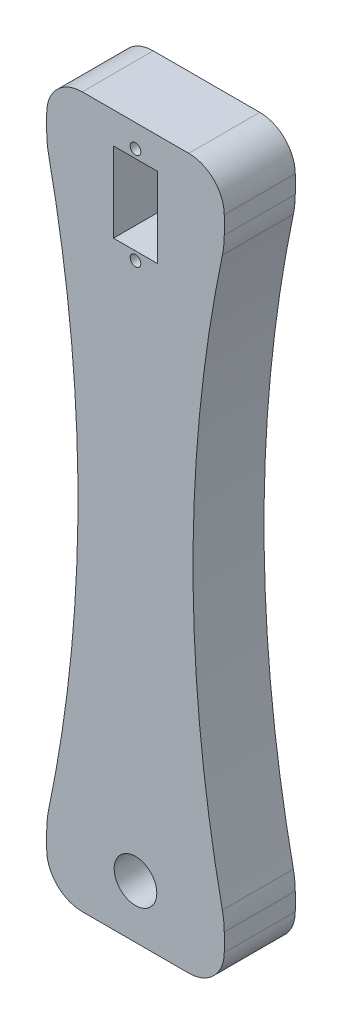
ISO-10303-21;
HEADER;
FILE_DESCRIPTION(('STEP AP214'),'2;1');
FILE_NAME('part.step','',(''),(''),'','','');
FILE_SCHEMA(('AUTOMOTIVE_DESIGN { 1 0 10303 214 1 1 1 1 }'));
ENDSEC;
DATA;
#1=APPLICATION_CONTEXT('core data for automotive mechanical design processes');
#2=APPLICATION_PROTOCOL_DEFINITION('international standard','automotive_design',2000,#1);
#3=PRODUCT_CONTEXT('',#1,'mechanical');
#4=PRODUCT('Part','Part','',(#3));
#5=PRODUCT_RELATED_PRODUCT_CATEGORY('part','',(#4));
#6=PRODUCT_DEFINITION_FORMATION('','',#4);
#7=PRODUCT_DEFINITION_CONTEXT('part definition',#1,'design');
#8=PRODUCT_DEFINITION('design','',#6,#7);
#9=PRODUCT_DEFINITION_SHAPE('','',#8);
#10=(LENGTH_UNIT() NAMED_UNIT(*) SI_UNIT(.MILLI.,.METRE.));
#11=(NAMED_UNIT(*) PLANE_ANGLE_UNIT() SI_UNIT($,.RADIAN.));
#12=(NAMED_UNIT(*) SI_UNIT($,.STERADIAN.) SOLID_ANGLE_UNIT());
#13=UNCERTAINTY_MEASURE_WITH_UNIT(LENGTH_MEASURE(1.E-05),#10,'distance_accuracy_value','');
#14=(GEOMETRIC_REPRESENTATION_CONTEXT(3) GLOBAL_UNCERTAINTY_ASSIGNED_CONTEXT((#13)) GLOBAL_UNIT_ASSIGNED_CONTEXT((#10,
#11,#12)) REPRESENTATION_CONTEXT('',''));
#15=CARTESIAN_POINT('',(0.,0.,0.));
#16=DIRECTION('',(0.,0.,1.));
#17=DIRECTION('',(1.,0.,0.));
#18=AXIS2_PLACEMENT_3D('',#15,#16,#17);
#19=CARTESIAN_POINT('',(0.,0.,20.));
#20=DIRECTION('',(1.,0.,0.));
#21=DIRECTION('',(0.,1.,0.));
#22=AXIS2_PLACEMENT_3D('',#19,#20,#21);
#23=PLANE('',#22);
#24=DIRECTION('',(0.,0.,-1.));
#25=VECTOR('',#24,1.);
#26=CARTESIAN_POINT('',(0.,-185.,20.000012));
#27=LINE('',#26,#25);
#28=CARTESIAN_POINT('',(0.,-185.,0.));
#29=VERTEX_POINT('',#28);
#30=CARTESIAN_POINT('',(0.,-185.,20.));
#31=VERTEX_POINT('',#30);
#32=EDGE_CURVE('E707',#29,#31,#27,.F.);
#33=ORIENTED_EDGE('',*,*,#32,.F.);
#34=DIRECTION('',(0.,-1.,0.));
#35=VECTOR('',#34,1.);
#36=CARTESIAN_POINT('',(0.,0.,0.));
#37=LINE('',#36,#35);
#38=CARTESIAN_POINT('',(0.,-190.,0.));
#39=VERTEX_POINT('',#38);
#40=EDGE_CURVE('E226',#29,#39,#37,.T.);
#41=ORIENTED_EDGE('',*,*,#40,.T.);
#42=DIRECTION('',(0.,0.,-1.));
#43=VECTOR('',#42,1.);
#44=CARTESIAN_POINT('',(0.,-190.,20.));
#45=LINE('',#44,#43);
#46=CARTESIAN_POINT('',(0.,-190.,20.));
#47=VERTEX_POINT('',#46);
#48=EDGE_CURVE('E258',#39,#47,#45,.F.);
#49=ORIENTED_EDGE('',*,*,#48,.T.);
#50=DIRECTION('',(0.,-1.,0.));
#51=VECTOR('',#50,1.);
#52=CARTESIAN_POINT('',(0.,0.,20.));
#53=LINE('',#52,#51);
#54=EDGE_CURVE('E236',#31,#47,#53,.T.);
#55=ORIENTED_EDGE('',*,*,#54,.F.);
#56=EDGE_LOOP('',(#33,#41,#49,#55));
#57=FACE_BOUND('',#56,.T.);
#58=ADVANCED_FACE('F38',(#57),#23,.F.);
#59=CARTESIAN_POINT('',(50.,0.,20.));
#60=DIRECTION('',(-1.,0.,0.));
#61=DIRECTION('',(0.,-1.,0.));
#62=AXIS2_PLACEMENT_3D('',#59,#60,#61);
#63=PLANE('',#62);
#64=DIRECTION('',(0.,0.,-1.));
#65=VECTOR('',#64,1.);
#66=CARTESIAN_POINT('',(50.,-15.,20.000012));
#67=LINE('',#66,#65);
#68=CARTESIAN_POINT('',(50.,-15.,0.));
#69=VERTEX_POINT('',#68);
#70=CARTESIAN_POINT('',(50.,-15.,20.));
#71=VERTEX_POINT('',#70);
#72=EDGE_CURVE('E175',#69,#71,#67,.F.);
#73=ORIENTED_EDGE('',*,*,#72,.F.);
#74=DIRECTION('',(0.,1.,0.));
#75=VECTOR('',#74,1.);
#76=CARTESIAN_POINT('',(50.,0.,0.));
#77=LINE('',#76,#75);
#78=CARTESIAN_POINT('',(50.,-10.,0.));
#79=VERTEX_POINT('',#78);
#80=EDGE_CURVE('E229',#69,#79,#77,.T.);
#81=ORIENTED_EDGE('',*,*,#80,.T.);
#82=DIRECTION('',(0.,0.,-1.));
#83=VECTOR('',#82,1.);
#84=CARTESIAN_POINT('',(50.,-10.,20.));
#85=LINE('',#84,#83);
#86=CARTESIAN_POINT('',(50.,-10.,20.));
#87=VERTEX_POINT('',#86);
#88=EDGE_CURVE('E200',#79,#87,#85,.F.);
#89=ORIENTED_EDGE('',*,*,#88,.T.);
#90=DIRECTION('',(0.,1.,0.));
#91=VECTOR('',#90,1.);
#92=CARTESIAN_POINT('',(50.,0.,20.));
#93=LINE('',#92,#91);
#94=EDGE_CURVE('E193',#71,#87,#93,.T.);
#95=ORIENTED_EDGE('',*,*,#94,.F.);
#96=EDGE_LOOP('',(#73,#81,#89,#95));
#97=FACE_BOUND('',#96,.T.);
#98=ADVANCED_FACE('F198',(#97),#63,.F.);
#99=CARTESIAN_POINT('',(0.,0.,20.));
#100=DIRECTION('',(0.,0.,1.));
#101=DIRECTION('',(1.,0.,0.));
#102=AXIS2_PLACEMENT_3D('',#99,#100,#101);
#103=PLANE('',#102);
#104=CARTESIAN_POINT('',(25.,-15.,20.));
#105=DIRECTION('',(0.,0.,1.));
#106=DIRECTION('',(1.,0.,0.));
#107=AXIS2_PLACEMENT_3D('',#104,#105,#106);
#108=CIRCLE('',#107,25.);
#109=CARTESIAN_POINT('',(49.4699951946866,-20.1204819277109,20.));
#110=VERTEX_POINT('',#109);
#111=EDGE_CURVE('E179',#71,#110,#108,.F.);
#112=ORIENTED_EDGE('',*,*,#111,.F.);
#113=ORIENTED_EDGE('',*,*,#94,.T.);
#114=CARTESIAN_POINT('',(40.,-10.,20.));
#115=DIRECTION('',(0.,0.,1.));
#116=DIRECTION('',(1.,0.,0.));
#117=AXIS2_PLACEMENT_3D('',#114,#115,#116);
#118=CIRCLE('',#117,10.);
#119=CARTESIAN_POINT('',(40.,0.,20.));
#120=VERTEX_POINT('',#119);
#121=EDGE_CURVE('E263',#87,#120,#118,.T.);
#122=ORIENTED_EDGE('',*,*,#121,.T.);
#123=DIRECTION('',(-1.,0.,0.));
#124=VECTOR('',#123,1.);
#125=CARTESIAN_POINT('',(0.,0.,20.));
#126=LINE('',#125,#124);
#127=CARTESIAN_POINT('',(10.,0.,20.));
#128=VERTEX_POINT('',#127);
#129=EDGE_CURVE('E206',#120,#128,#126,.T.);
#130=ORIENTED_EDGE('',*,*,#129,.T.);
#131=CARTESIAN_POINT('',(10.,-10.,20.));
#132=DIRECTION('',(0.,0.,1.));
#133=DIRECTION('',(1.,0.,0.));
#134=AXIS2_PLACEMENT_3D('',#131,#132,#133);
#135=CIRCLE('',#134,10.);
#136=CARTESIAN_POINT('',(0.,-10.,20.));
#137=VERTEX_POINT('',#136);
#138=EDGE_CURVE('E265',#128,#137,#135,.T.);
#139=ORIENTED_EDGE('',*,*,#138,.T.);
#140=CARTESIAN_POINT('',(0.,-15.,20.));
#141=VERTEX_POINT('',#140);
#142=EDGE_CURVE('E209',#137,#141,#53,.T.);
#143=ORIENTED_EDGE('',*,*,#142,.T.);
#144=CARTESIAN_POINT('',(25.,-15.,20.));
#145=DIRECTION('',(0.,0.,1.));
#146=DIRECTION('',(1.,0.,0.));
#147=AXIS2_PLACEMENT_3D('',#144,#145,#146);
#148=CIRCLE('',#147,25.);
#149=CARTESIAN_POINT('',(0.530004805313376,-20.1204819277108,20.));
#150=VERTEX_POINT('',#149);
#151=EDGE_CURVE('E53',#150,#141,#148,.F.);
#152=ORIENTED_EDGE('',*,*,#151,.F.);
#153=CARTESIAN_POINT('',(-381.201920231798,-100.,20.));
#154=DIRECTION('',(0.,0.,1.));
#155=DIRECTION('',(1.,0.,0.));
#156=AXIS2_PLACEMENT_3D('',#153,#154,#155);
#157=CIRCLE('',#156,390.);
#158=CARTESIAN_POINT('',(0.530004805313344,-179.879518072289,20.));
#159=VERTEX_POINT('',#158);
#160=EDGE_CURVE('E359',#150,#159,#157,.F.);
#161=ORIENTED_EDGE('',*,*,#160,.T.);
#162=CARTESIAN_POINT('',(25.,-185.,20.));
#163=DIRECTION('',(0.,0.,1.));
#164=DIRECTION('',(1.,0.,0.));
#165=AXIS2_PLACEMENT_3D('',#162,#163,#164);
#166=CIRCLE('',#165,25.);
#167=EDGE_CURVE('E316',#31,#159,#166,.F.);
#168=ORIENTED_EDGE('',*,*,#167,.F.);
#169=ORIENTED_EDGE('',*,*,#54,.T.);
#170=CARTESIAN_POINT('',(10.,-190.,20.));
#171=DIRECTION('',(0.,0.,1.));
#172=DIRECTION('',(1.,0.,0.));
#173=AXIS2_PLACEMENT_3D('',#170,#171,#172);
#174=CIRCLE('',#173,10.);
#175=CARTESIAN_POINT('',(10.,-200.,20.));
#176=VERTEX_POINT('',#175);
#177=EDGE_CURVE('E267',#47,#176,#174,.T.);
#178=ORIENTED_EDGE('',*,*,#177,.T.);
#179=DIRECTION('',(1.,0.,0.));
#180=VECTOR('',#179,1.);
#181=CARTESIAN_POINT('',(0.,-200.,20.));
#182=LINE('',#181,#180);
#183=CARTESIAN_POINT('',(40.,-200.,20.));
#184=VERTEX_POINT('',#183);
#185=EDGE_CURVE('E203',#176,#184,#182,.T.);
#186=ORIENTED_EDGE('',*,*,#185,.T.);
#187=CARTESIAN_POINT('',(40.,-190.,20.));
#188=DIRECTION('',(0.,0.,1.));
#189=DIRECTION('',(1.,0.,0.));
#190=AXIS2_PLACEMENT_3D('',#187,#188,#189);
#191=CIRCLE('',#190,10.);
#192=CARTESIAN_POINT('',(50.,-190.,20.));
#193=VERTEX_POINT('',#192);
#194=EDGE_CURVE('E261',#184,#193,#191,.T.);
#195=ORIENTED_EDGE('',*,*,#194,.T.);
#196=CARTESIAN_POINT('',(50.,-185.,20.));
#197=VERTEX_POINT('',#196);
#198=EDGE_CURVE('E202',#193,#197,#93,.T.);
#199=ORIENTED_EDGE('',*,*,#198,.T.);
#200=CARTESIAN_POINT('',(25.,-185.,20.));
#201=DIRECTION('',(0.,0.,1.));
#202=DIRECTION('',(1.,0.,0.));
#203=AXIS2_PLACEMENT_3D('',#200,#201,#202);
#204=CIRCLE('',#203,25.);
#205=CARTESIAN_POINT('',(49.4699951946867,-179.879518072289,20.));
#206=VERTEX_POINT('',#205);
#207=EDGE_CURVE('E61',#206,#197,#204,.F.);
#208=ORIENTED_EDGE('',*,*,#207,.F.);
#209=CARTESIAN_POINT('',(431.201920231798,-99.9999999999999,20.));
#210=DIRECTION('',(0.,0.,1.));
#211=DIRECTION('',(1.,0.,0.));
#212=AXIS2_PLACEMENT_3D('',#209,#210,#211);
#213=CIRCLE('',#212,390.);
#214=EDGE_CURVE('E195',#206,#110,#213,.F.);
#215=ORIENTED_EDGE('',*,*,#214,.T.);
#216=EDGE_LOOP('',(#112,#113,#122,#130,#139,#143,#152,#161,#168,#169,#178,#186,#195,#199,#208,#215));
#217=FACE_BOUND('',#216,.T.);
#218=CARTESIAN_POINT('',(25.,-6.4,20.));
#219=DIRECTION('',(0.,0.,1.));
#220=DIRECTION('',(1.,0.,0.));
#221=AXIS2_PLACEMENT_3D('',#218,#219,#220);
#222=CIRCLE('',#221,1.5);
#223=CARTESIAN_POINT('',(26.5,-6.4,20.));
#224=VERTEX_POINT('',#223);
#225=EDGE_CURVE('E364',#224,#224,#222,.T.);
#226=ORIENTED_EDGE('',*,*,#225,.F.);
#227=EDGE_LOOP('',(#226));
#228=FACE_BOUND('',#227,.T.);
#229=CARTESIAN_POINT('',(25.,-33.7,20.));
#230=DIRECTION('',(0.,0.,1.));
#231=DIRECTION('',(1.,0.,0.));
#232=AXIS2_PLACEMENT_3D('',#229,#230,#231);
#233=CIRCLE('',#232,1.5);
#234=CARTESIAN_POINT('',(26.5,-33.7,20.));
#235=VERTEX_POINT('',#234);
#236=EDGE_CURVE('E365',#235,#235,#233,.T.);
#237=ORIENTED_EDGE('',*,*,#236,.F.);
#238=EDGE_LOOP('',(#237));
#239=FACE_BOUND('',#238,.T.);
#240=CARTESIAN_POINT('',(25.,-185.,20.));
#241=DIRECTION('',(0.,0.,1.));
#242=DIRECTION('',(1.,0.,0.));
#243=AXIS2_PLACEMENT_3D('',#240,#241,#242);
#244=CIRCLE('',#243,6.);
#245=CARTESIAN_POINT('',(31.,-185.,20.));
#246=VERTEX_POINT('',#245);
#247=EDGE_CURVE('E240',#246,#246,#244,.T.);
#248=ORIENTED_EDGE('',*,*,#247,.F.);
#249=EDGE_LOOP('',(#248));
#250=FACE_BOUND('',#249,.T.);
#251=DIRECTION('',(0.,1.,0.));
#252=VECTOR('',#251,1.);
#253=CARTESIAN_POINT('',(18.8,0.,20.));
#254=LINE('',#253,#252);
#255=CARTESIAN_POINT('',(18.8,-31.3,20.));
#256=VERTEX_POINT('',#255);
#257=CARTESIAN_POINT('',(18.8,-8.8,20.));
#258=VERTEX_POINT('',#257);
#259=EDGE_CURVE('E373',#256,#258,#254,.T.);
#260=ORIENTED_EDGE('',*,*,#259,.T.);
#261=DIRECTION('',(1.,0.,0.));
#262=VECTOR('',#261,1.);
#263=CARTESIAN_POINT('',(0.,-8.8,20.));
#264=LINE('',#263,#262);
#265=CARTESIAN_POINT('',(31.2,-8.8,20.));
#266=VERTEX_POINT('',#265);
#267=EDGE_CURVE('E368',#258,#266,#264,.T.);
#268=ORIENTED_EDGE('',*,*,#267,.T.);
#269=DIRECTION('',(0.,-1.,0.));
#270=VECTOR('',#269,1.);
#271=CARTESIAN_POINT('',(31.2,0.,20.));
#272=LINE('',#271,#270);
#273=CARTESIAN_POINT('',(31.2,-31.3,20.));
#274=VERTEX_POINT('',#273);
#275=EDGE_CURVE('E379',#266,#274,#272,.T.);
#276=ORIENTED_EDGE('',*,*,#275,.T.);
#277=DIRECTION('',(-1.,0.,0.));
#278=VECTOR('',#277,1.);
#279=CARTESIAN_POINT('',(0.,-31.3,20.));
#280=LINE('',#279,#278);
#281=EDGE_CURVE('E376',#274,#256,#280,.T.);
#282=ORIENTED_EDGE('',*,*,#281,.T.);
#283=EDGE_LOOP('',(#260,#268,#276,#282));
#284=FACE_BOUND('',#283,.T.);
#285=ADVANCED_FACE('F191',(#217,#228,#239,#250,#284),#103,.T.);
#286=CARTESIAN_POINT('',(0.,0.,0.));
#287=DIRECTION('',(0.,0.,1.));
#288=DIRECTION('',(1.,0.,0.));
#289=AXIS2_PLACEMENT_3D('',#286,#287,#288);
#290=PLANE('',#289);
#291=CARTESIAN_POINT('',(25.,-6.4,0.));
#292=DIRECTION('',(0.,0.,1.));
#293=DIRECTION('',(1.,0.,0.));
#294=AXIS2_PLACEMENT_3D('',#291,#292,#293);
#295=CIRCLE('',#294,1.5);
#296=CARTESIAN_POINT('',(26.5,-6.4,0.));
#297=VERTEX_POINT('',#296);
#298=EDGE_CURVE('E289',#297,#297,#295,.T.);
#299=ORIENTED_EDGE('',*,*,#298,.T.);
#300=EDGE_LOOP('',(#299));
#301=FACE_BOUND('',#300,.T.);
#302=CARTESIAN_POINT('',(25.,-33.7,0.));
#303=DIRECTION('',(0.,0.,1.));
#304=DIRECTION('',(1.,0.,0.));
#305=AXIS2_PLACEMENT_3D('',#302,#303,#304);
#306=CIRCLE('',#305,1.5);
#307=CARTESIAN_POINT('',(26.5,-33.7,0.));
#308=VERTEX_POINT('',#307);
#309=EDGE_CURVE('E287',#308,#308,#306,.T.);
#310=ORIENTED_EDGE('',*,*,#309,.T.);
#311=EDGE_LOOP('',(#310));
#312=FACE_BOUND('',#311,.T.);
#313=ORIENTED_EDGE('',*,*,#80,.F.);
#314=CARTESIAN_POINT('',(25.,-15.,0.));
#315=DIRECTION('',(0.,0.,1.));
#316=DIRECTION('',(1.,0.,0.));
#317=AXIS2_PLACEMENT_3D('',#314,#315,#316);
#318=CIRCLE('',#317,25.);
#319=CARTESIAN_POINT('',(49.4699951946866,-20.1204819277109,0.));
#320=VERTEX_POINT('',#319);
#321=EDGE_CURVE('E182',#69,#320,#318,.F.);
#322=ORIENTED_EDGE('',*,*,#321,.T.);
#323=CARTESIAN_POINT('',(431.201920231798,-99.9999999999999,0.));
#324=DIRECTION('',(0.,0.,1.));
#325=DIRECTION('',(1.,0.,0.));
#326=AXIS2_PLACEMENT_3D('',#323,#324,#325);
#327=CIRCLE('',#326,390.);
#328=CARTESIAN_POINT('',(49.4699951946867,-179.879518072289,0.));
#329=VERTEX_POINT('',#328);
#330=EDGE_CURVE('E12',#329,#320,#327,.F.);
#331=ORIENTED_EDGE('',*,*,#330,.F.);
#332=CARTESIAN_POINT('',(25.,-185.,0.));
#333=DIRECTION('',(0.,0.,1.));
#334=DIRECTION('',(1.,0.,0.));
#335=AXIS2_PLACEMENT_3D('',#332,#333,#334);
#336=CIRCLE('',#335,25.);
#337=CARTESIAN_POINT('',(50.,-185.,0.));
#338=VERTEX_POINT('',#337);
#339=EDGE_CURVE('E339',#329,#338,#336,.F.);
#340=ORIENTED_EDGE('',*,*,#339,.T.);
#341=CARTESIAN_POINT('',(50.,-190.,0.));
#342=VERTEX_POINT('',#341);
#343=EDGE_CURVE('E230',#342,#338,#77,.T.);
#344=ORIENTED_EDGE('',*,*,#343,.F.);
#345=CARTESIAN_POINT('',(40.,-190.,0.));
#346=DIRECTION('',(0.,0.,1.));
#347=DIRECTION('',(1.,0.,0.));
#348=AXIS2_PLACEMENT_3D('',#345,#346,#347);
#349=CIRCLE('',#348,10.);
#350=CARTESIAN_POINT('',(40.,-200.,0.));
#351=VERTEX_POINT('',#350);
#352=EDGE_CURVE('E245',#342,#351,#349,.F.);
#353=ORIENTED_EDGE('',*,*,#352,.T.);
#354=DIRECTION('',(1.,0.,0.));
#355=VECTOR('',#354,1.);
#356=CARTESIAN_POINT('',(0.,-200.,0.));
#357=LINE('',#356,#355);
#358=CARTESIAN_POINT('',(10.,-200.,0.));
#359=VERTEX_POINT('',#358);
#360=EDGE_CURVE('E225',#359,#351,#357,.T.);
#361=ORIENTED_EDGE('',*,*,#360,.F.);
#362=CARTESIAN_POINT('',(10.,-190.,0.));
#363=DIRECTION('',(0.,0.,1.));
#364=DIRECTION('',(1.,0.,0.));
#365=AXIS2_PLACEMENT_3D('',#362,#363,#364);
#366=CIRCLE('',#365,10.);
#367=EDGE_CURVE('E252',#359,#39,#366,.F.);
#368=ORIENTED_EDGE('',*,*,#367,.T.);
#369=ORIENTED_EDGE('',*,*,#40,.F.);
#370=CARTESIAN_POINT('',(25.,-185.,0.));
#371=DIRECTION('',(0.,0.,1.));
#372=DIRECTION('',(1.,0.,0.));
#373=AXIS2_PLACEMENT_3D('',#370,#371,#372);
#374=CIRCLE('',#373,25.);
#375=CARTESIAN_POINT('',(0.530004805313344,-179.879518072289,0.));
#376=VERTEX_POINT('',#375);
#377=EDGE_CURVE('E353',#29,#376,#374,.F.);
#378=ORIENTED_EDGE('',*,*,#377,.T.);
#379=CARTESIAN_POINT('',(-381.201920231798,-100.,0.));
#380=DIRECTION('',(0.,0.,1.));
#381=DIRECTION('',(1.,0.,0.));
#382=AXIS2_PLACEMENT_3D('',#379,#380,#381);
#383=CIRCLE('',#382,390.);
#384=CARTESIAN_POINT('',(0.530004805313376,-20.1204819277108,0.));
#385=VERTEX_POINT('',#384);
#386=EDGE_CURVE('E46',#385,#376,#383,.F.);
#387=ORIENTED_EDGE('',*,*,#386,.F.);
#388=CARTESIAN_POINT('',(25.,-15.,0.));
#389=DIRECTION('',(0.,0.,1.));
#390=DIRECTION('',(1.,0.,0.));
#391=AXIS2_PLACEMENT_3D('',#388,#389,#390);
#392=CIRCLE('',#391,25.);
#393=CARTESIAN_POINT('',(0.,-15.,0.));
#394=VERTEX_POINT('',#393);
#395=EDGE_CURVE('E196',#385,#394,#392,.F.);
#396=ORIENTED_EDGE('',*,*,#395,.T.);
#397=CARTESIAN_POINT('',(0.,-10.,0.));
#398=VERTEX_POINT('',#397);
#399=EDGE_CURVE('E222',#398,#394,#37,.T.);
#400=ORIENTED_EDGE('',*,*,#399,.F.);
#401=CARTESIAN_POINT('',(10.,-10.,0.));
#402=DIRECTION('',(0.,0.,1.));
#403=DIRECTION('',(1.,0.,0.));
#404=AXIS2_PLACEMENT_3D('',#401,#402,#403);
#405=CIRCLE('',#404,10.);
#406=CARTESIAN_POINT('',(10.,0.,0.));
#407=VERTEX_POINT('',#406);
#408=EDGE_CURVE('E250',#398,#407,#405,.F.);
#409=ORIENTED_EDGE('',*,*,#408,.T.);
#410=DIRECTION('',(-1.,0.,0.));
#411=VECTOR('',#410,1.);
#412=CARTESIAN_POINT('',(0.,0.,0.));
#413=LINE('',#412,#411);
#414=CARTESIAN_POINT('',(40.,0.,0.));
#415=VERTEX_POINT('',#414);
#416=EDGE_CURVE('E233',#415,#407,#413,.T.);
#417=ORIENTED_EDGE('',*,*,#416,.F.);
#418=CARTESIAN_POINT('',(40.,-10.,0.));
#419=DIRECTION('',(0.,0.,1.));
#420=DIRECTION('',(1.,0.,0.));
#421=AXIS2_PLACEMENT_3D('',#418,#419,#420);
#422=CIRCLE('',#421,10.);
#423=EDGE_CURVE('E247',#415,#79,#422,.F.);
#424=ORIENTED_EDGE('',*,*,#423,.T.);
#425=EDGE_LOOP('',(#313,#322,#331,#340,#344,#353,#361,#368,#369,#378,#387,#396,#400,#409,#417,#424));
#426=FACE_BOUND('',#425,.T.);
#427=CARTESIAN_POINT('',(25.,-185.,0.));
#428=DIRECTION('',(0.,0.,1.));
#429=DIRECTION('',(1.,0.,0.));
#430=AXIS2_PLACEMENT_3D('',#427,#428,#429);
#431=CIRCLE('',#430,6.);
#432=CARTESIAN_POINT('',(31.,-185.,0.));
#433=VERTEX_POINT('',#432);
#434=EDGE_CURVE('E237',#433,#433,#431,.T.);
#435=ORIENTED_EDGE('',*,*,#434,.T.);
#436=EDGE_LOOP('',(#435));
#437=FACE_BOUND('',#436,.T.);
#438=DIRECTION('',(1.,0.,0.));
#439=VECTOR('',#438,1.);
#440=CARTESIAN_POINT('',(0.,-8.8,0.));
#441=LINE('',#440,#439);
#442=CARTESIAN_POINT('',(18.8,-8.8,0.));
#443=VERTEX_POINT('',#442);
#444=CARTESIAN_POINT('',(31.2,-8.8,0.));
#445=VERTEX_POINT('',#444);
#446=EDGE_CURVE('E285',#443,#445,#441,.T.);
#447=ORIENTED_EDGE('',*,*,#446,.F.);
#448=DIRECTION('',(0.,1.,0.));
#449=VECTOR('',#448,1.);
#450=CARTESIAN_POINT('',(18.8,0.,0.));
#451=LINE('',#450,#449);
#452=CARTESIAN_POINT('',(18.8,-31.3,0.));
#453=VERTEX_POINT('',#452);
#454=EDGE_CURVE('E278',#453,#443,#451,.T.);
#455=ORIENTED_EDGE('',*,*,#454,.F.);
#456=DIRECTION('',(-1.,0.,0.));
#457=VECTOR('',#456,1.);
#458=CARTESIAN_POINT('',(0.,-31.3,0.));
#459=LINE('',#458,#457);
#460=CARTESIAN_POINT('',(31.2,-31.3,0.));
#461=VERTEX_POINT('',#460);
#462=EDGE_CURVE('E280',#461,#453,#459,.T.);
#463=ORIENTED_EDGE('',*,*,#462,.F.);
#464=DIRECTION('',(0.,-1.,0.));
#465=VECTOR('',#464,1.);
#466=CARTESIAN_POINT('',(31.2,0.,0.));
#467=LINE('',#466,#465);
#468=EDGE_CURVE('E283',#445,#461,#467,.T.);
#469=ORIENTED_EDGE('',*,*,#468,.F.);
#470=EDGE_LOOP('',(#447,#455,#463,#469));
#471=FACE_BOUND('',#470,.T.);
#472=ADVANCED_FACE('F329',(#301,#312,#426,#437,#471),#290,.F.);
#473=ORIENTED_EDGE('',*,*,#399,.T.);
#474=DIRECTION('',(0.,0.,-1.));
#475=VECTOR('',#474,1.);
#476=CARTESIAN_POINT('',(0.,-15.,20.000012));
#477=LINE('',#476,#475);
#478=EDGE_CURVE('E186',#394,#141,#477,.F.);
#479=ORIENTED_EDGE('',*,*,#478,.T.);
#480=ORIENTED_EDGE('',*,*,#142,.F.);
#481=DIRECTION('',(0.,0.,-1.));
#482=VECTOR('',#481,1.);
#483=CARTESIAN_POINT('',(0.,-10.,20.));
#484=LINE('',#483,#482);
#485=EDGE_CURVE('E255',#137,#398,#484,.T.);
#486=ORIENTED_EDGE('',*,*,#485,.T.);
#487=EDGE_LOOP('',(#473,#479,#480,#486));
#488=FACE_BOUND('',#487,.T.);
#489=ADVANCED_FACE('F417',(#488),#23,.F.);
#490=CARTESIAN_POINT('',(0.,-200.,20.));
#491=DIRECTION('',(0.,1.,0.));
#492=DIRECTION('',(0.,0.,1.));
#493=AXIS2_PLACEMENT_3D('',#490,#491,#492);
#494=PLANE('',#493);
#495=ORIENTED_EDGE('',*,*,#185,.F.);
#496=DIRECTION('',(0.,0.,-1.));
#497=VECTOR('',#496,1.);
#498=CARTESIAN_POINT('',(10.,-200.,20.));
#499=LINE('',#498,#497);
#500=EDGE_CURVE('E242',#176,#359,#499,.T.);
#501=ORIENTED_EDGE('',*,*,#500,.T.);
#502=ORIENTED_EDGE('',*,*,#360,.T.);
#503=DIRECTION('',(0.,0.,-1.));
#504=VECTOR('',#503,1.);
#505=CARTESIAN_POINT('',(40.,-200.,20.));
#506=LINE('',#505,#504);
#507=EDGE_CURVE('E221',#351,#184,#506,.F.);
#508=ORIENTED_EDGE('',*,*,#507,.T.);
#509=EDGE_LOOP('',(#495,#501,#502,#508));
#510=FACE_BOUND('',#509,.T.);
#511=ADVANCED_FACE('F326',(#510),#494,.F.);
#512=ORIENTED_EDGE('',*,*,#343,.T.);
#513=DIRECTION('',(0.,0.,-1.));
#514=VECTOR('',#513,1.);
#515=CARTESIAN_POINT('',(50.,-185.,20.000012));
#516=LINE('',#515,#514);
#517=EDGE_CURVE('E187',#338,#197,#516,.F.);
#518=ORIENTED_EDGE('',*,*,#517,.T.);
#519=ORIENTED_EDGE('',*,*,#198,.F.);
#520=DIRECTION('',(0.,0.,-1.));
#521=VECTOR('',#520,1.);
#522=CARTESIAN_POINT('',(50.,-190.,20.));
#523=LINE('',#522,#521);
#524=EDGE_CURVE('E274',#193,#342,#523,.T.);
#525=ORIENTED_EDGE('',*,*,#524,.T.);
#526=EDGE_LOOP('',(#512,#518,#519,#525));
#527=FACE_BOUND('',#526,.T.);
#528=ADVANCED_FACE('F338',(#527),#63,.F.);
#529=CARTESIAN_POINT('',(0.,0.,20.));
#530=DIRECTION('',(0.,-1.,0.));
#531=DIRECTION('',(0.,0.,-1.));
#532=AXIS2_PLACEMENT_3D('',#529,#530,#531);
#533=PLANE('',#532);
#534=ORIENTED_EDGE('',*,*,#416,.T.);
#535=DIRECTION('',(0.,0.,-1.));
#536=VECTOR('',#535,1.);
#537=CARTESIAN_POINT('',(10.,0.,20.));
#538=LINE('',#537,#536);
#539=EDGE_CURVE('E272',#407,#128,#538,.F.);
#540=ORIENTED_EDGE('',*,*,#539,.T.);
#541=ORIENTED_EDGE('',*,*,#129,.F.);
#542=DIRECTION('',(0.,0.,-1.));
#543=VECTOR('',#542,1.);
#544=CARTESIAN_POINT('',(40.,0.,20.));
#545=LINE('',#544,#543);
#546=EDGE_CURVE('E269',#120,#415,#545,.T.);
#547=ORIENTED_EDGE('',*,*,#546,.T.);
#548=EDGE_LOOP('',(#534,#540,#541,#547));
#549=FACE_BOUND('',#548,.T.);
#550=ADVANCED_FACE('F459',(#549),#533,.F.);
#551=CARTESIAN_POINT('',(25.,-185.,-64.));
#552=DIRECTION('',(0.,0.,1.));
#553=DIRECTION('',(1.,0.,0.));
#554=AXIS2_PLACEMENT_3D('',#551,#552,#553);
#555=CYLINDRICAL_SURFACE('',#554,6.);
#556=ORIENTED_EDGE('',*,*,#247,.T.);
#557=EDGE_LOOP('',(#556));
#558=FACE_BOUND('',#557,.T.);
#559=ORIENTED_EDGE('',*,*,#434,.F.);
#560=EDGE_LOOP('',(#559));
#561=FACE_BOUND('',#560,.T.);
#562=ADVANCED_FACE('F469',(#558,#561),#555,.F.);
#563=CARTESIAN_POINT('',(10.,-190.,20.));
#564=DIRECTION('',(0.,0.,-1.));
#565=DIRECTION('',(-1.,0.,0.));
#566=AXIS2_PLACEMENT_3D('',#563,#564,#565);
#567=CYLINDRICAL_SURFACE('',#566,10.);
#568=ORIENTED_EDGE('',*,*,#177,.F.);
#569=ORIENTED_EDGE('',*,*,#48,.F.);
#570=ORIENTED_EDGE('',*,*,#367,.F.);
#571=ORIENTED_EDGE('',*,*,#500,.F.);
#572=EDGE_LOOP('',(#568,#569,#570,#571));
#573=FACE_BOUND('',#572,.T.);
#574=ADVANCED_FACE('F323',(#573),#567,.T.);
#575=CARTESIAN_POINT('',(10.,-10.,20.));
#576=DIRECTION('',(0.,0.,-1.));
#577=DIRECTION('',(-1.,0.,0.));
#578=AXIS2_PLACEMENT_3D('',#575,#576,#577);
#579=CYLINDRICAL_SURFACE('',#578,10.);
#580=ORIENTED_EDGE('',*,*,#138,.F.);
#581=ORIENTED_EDGE('',*,*,#539,.F.);
#582=ORIENTED_EDGE('',*,*,#408,.F.);
#583=ORIENTED_EDGE('',*,*,#485,.F.);
#584=EDGE_LOOP('',(#580,#581,#582,#583));
#585=FACE_BOUND('',#584,.T.);
#586=ADVANCED_FACE('F462',(#585),#579,.T.);
#587=CARTESIAN_POINT('',(40.,-10.,20.));
#588=DIRECTION('',(0.,0.,-1.));
#589=DIRECTION('',(-1.,0.,0.));
#590=AXIS2_PLACEMENT_3D('',#587,#588,#589);
#591=CYLINDRICAL_SURFACE('',#590,10.);
#592=ORIENTED_EDGE('',*,*,#121,.F.);
#593=ORIENTED_EDGE('',*,*,#88,.F.);
#594=ORIENTED_EDGE('',*,*,#423,.F.);
#595=ORIENTED_EDGE('',*,*,#546,.F.);
#596=EDGE_LOOP('',(#592,#593,#594,#595));
#597=FACE_BOUND('',#596,.T.);
#598=ADVANCED_FACE('F455',(#597),#591,.T.);
#599=CARTESIAN_POINT('',(40.,-190.,20.));
#600=DIRECTION('',(0.,0.,-1.));
#601=DIRECTION('',(-1.,0.,0.));
#602=AXIS2_PLACEMENT_3D('',#599,#600,#601);
#603=CYLINDRICAL_SURFACE('',#602,10.);
#604=ORIENTED_EDGE('',*,*,#194,.F.);
#605=ORIENTED_EDGE('',*,*,#507,.F.);
#606=ORIENTED_EDGE('',*,*,#352,.F.);
#607=ORIENTED_EDGE('',*,*,#524,.F.);
#608=EDGE_LOOP('',(#604,#605,#606,#607));
#609=FACE_BOUND('',#608,.T.);
#610=ADVANCED_FACE('F40',(#609),#603,.T.);
#611=CARTESIAN_POINT('',(0.,-8.8,-13.));
#612=DIRECTION('',(0.,-1.,0.));
#613=DIRECTION('',(0.,0.,-1.));
#614=AXIS2_PLACEMENT_3D('',#611,#612,#613);
#615=PLANE('',#614);
#616=ORIENTED_EDGE('',*,*,#446,.T.);
#617=DIRECTION('',(0.,0.,1.));
#618=VECTOR('',#617,1.);
#619=CARTESIAN_POINT('',(31.2,-8.8,-13.));
#620=LINE('',#619,#618);
#621=EDGE_CURVE('E290',#445,#266,#620,.T.);
#622=ORIENTED_EDGE('',*,*,#621,.T.);
#623=ORIENTED_EDGE('',*,*,#267,.F.);
#624=DIRECTION('',(0.,0.,1.));
#625=VECTOR('',#624,1.);
#626=CARTESIAN_POINT('',(18.8,-8.8,-13.));
#627=LINE('',#626,#625);
#628=EDGE_CURVE('E299',#443,#258,#627,.T.);
#629=ORIENTED_EDGE('',*,*,#628,.F.);
#630=EDGE_LOOP('',(#616,#622,#623,#629));
#631=FACE_BOUND('',#630,.T.);
#632=ADVANCED_FACE('F404',(#631),#615,.T.);
#633=CARTESIAN_POINT('',(31.2,0.,-13.));
#634=DIRECTION('',(-1.,0.,0.));
#635=DIRECTION('',(0.,0.,1.));
#636=AXIS2_PLACEMENT_3D('',#633,#634,#635);
#637=PLANE('',#636);
#638=ORIENTED_EDGE('',*,*,#468,.T.);
#639=DIRECTION('',(0.,0.,1.));
#640=VECTOR('',#639,1.);
#641=CARTESIAN_POINT('',(31.2,-31.3,-13.));
#642=LINE('',#641,#640);
#643=EDGE_CURVE('E383',#461,#274,#642,.T.);
#644=ORIENTED_EDGE('',*,*,#643,.T.);
#645=ORIENTED_EDGE('',*,*,#275,.F.);
#646=ORIENTED_EDGE('',*,*,#621,.F.);
#647=EDGE_LOOP('',(#638,#644,#645,#646));
#648=FACE_BOUND('',#647,.T.);
#649=ADVANCED_FACE('F405',(#648),#637,.T.);
#650=CARTESIAN_POINT('',(0.,-31.3,-13.));
#651=DIRECTION('',(0.,1.,0.));
#652=DIRECTION('',(0.,0.,1.));
#653=AXIS2_PLACEMENT_3D('',#650,#651,#652);
#654=PLANE('',#653);
#655=ORIENTED_EDGE('',*,*,#462,.T.);
#656=DIRECTION('',(0.,0.,1.));
#657=VECTOR('',#656,1.);
#658=CARTESIAN_POINT('',(18.8,-31.3,-13.));
#659=LINE('',#658,#657);
#660=EDGE_CURVE('E384',#453,#256,#659,.T.);
#661=ORIENTED_EDGE('',*,*,#660,.T.);
#662=ORIENTED_EDGE('',*,*,#281,.F.);
#663=ORIENTED_EDGE('',*,*,#643,.F.);
#664=EDGE_LOOP('',(#655,#661,#662,#663));
#665=FACE_BOUND('',#664,.T.);
#666=ADVANCED_FACE('F398',(#665),#654,.T.);
#667=CARTESIAN_POINT('',(18.8,0.,-13.));
#668=DIRECTION('',(1.,0.,0.));
#669=DIRECTION('',(0.,0.,-1.));
#670=AXIS2_PLACEMENT_3D('',#667,#668,#669);
#671=PLANE('',#670);
#672=ORIENTED_EDGE('',*,*,#454,.T.);
#673=ORIENTED_EDGE('',*,*,#628,.T.);
#674=ORIENTED_EDGE('',*,*,#259,.F.);
#675=ORIENTED_EDGE('',*,*,#660,.F.);
#676=EDGE_LOOP('',(#672,#673,#674,#675));
#677=FACE_BOUND('',#676,.T.);
#678=ADVANCED_FACE('F391',(#677),#671,.T.);
#679=CARTESIAN_POINT('',(25.,-33.7,-13.));
#680=DIRECTION('',(0.,0.,1.));
#681=DIRECTION('',(1.,0.,0.));
#682=AXIS2_PLACEMENT_3D('',#679,#680,#681);
#683=CYLINDRICAL_SURFACE('',#682,1.5);
#684=ORIENTED_EDGE('',*,*,#236,.T.);
#685=EDGE_LOOP('',(#684));
#686=FACE_BOUND('',#685,.T.);
#687=ORIENTED_EDGE('',*,*,#309,.F.);
#688=EDGE_LOOP('',(#687));
#689=FACE_BOUND('',#688,.T.);
#690=ADVANCED_FACE('F568',(#686,#689),#683,.F.);
#691=CARTESIAN_POINT('',(25.,-6.4,-13.));
#692=DIRECTION('',(0.,0.,1.));
#693=DIRECTION('',(1.,0.,0.));
#694=AXIS2_PLACEMENT_3D('',#691,#692,#693);
#695=CYLINDRICAL_SURFACE('',#694,1.5);
#696=ORIENTED_EDGE('',*,*,#225,.T.);
#697=EDGE_LOOP('',(#696));
#698=FACE_BOUND('',#697,.T.);
#699=ORIENTED_EDGE('',*,*,#298,.F.);
#700=EDGE_LOOP('',(#699));
#701=FACE_BOUND('',#700,.T.);
#702=ADVANCED_FACE('F493',(#698,#701),#695,.F.);
#703=CARTESIAN_POINT('',(431.201920231798,-99.9999999999999,20.000012));
#704=DIRECTION('',(0.,0.,-1.));
#705=DIRECTION('',(-1.,0.,0.));
#706=AXIS2_PLACEMENT_3D('',#703,#704,#705);
#707=CYLINDRICAL_SURFACE('',#706,390.);
#708=DIRECTION('',(0.,0.,-1.));
#709=VECTOR('',#708,1.);
#710=CARTESIAN_POINT('',(49.4699951946867,-179.879518072289,20.000012));
#711=LINE('',#710,#709);
#712=EDGE_CURVE('E446',#206,#329,#711,.T.);
#713=ORIENTED_EDGE('',*,*,#712,.T.);
#714=ORIENTED_EDGE('',*,*,#330,.T.);
#715=DIRECTION('',(0.,0.,-1.));
#716=VECTOR('',#715,1.);
#717=CARTESIAN_POINT('',(49.4699951946866,-20.1204819277109,20.000012));
#718=LINE('',#717,#716);
#719=EDGE_CURVE('E342',#110,#320,#718,.T.);
#720=ORIENTED_EDGE('',*,*,#719,.F.);
#721=ORIENTED_EDGE('',*,*,#214,.F.);
#722=EDGE_LOOP('',(#713,#714,#720,#721));
#723=FACE_BOUND('',#722,.T.);
#724=ADVANCED_FACE('F452',(#723),#707,.F.);
#725=CARTESIAN_POINT('',(25.,-15.,20.000012));
#726=DIRECTION('',(0.,0.,-1.));
#727=DIRECTION('',(-1.,0.,0.));
#728=AXIS2_PLACEMENT_3D('',#725,#726,#727);
#729=CYLINDRICAL_SURFACE('',#728,25.);
#730=ORIENTED_EDGE('',*,*,#111,.T.);
#731=ORIENTED_EDGE('',*,*,#719,.T.);
#732=ORIENTED_EDGE('',*,*,#321,.F.);
#733=ORIENTED_EDGE('',*,*,#72,.T.);
#734=EDGE_LOOP('',(#730,#731,#732,#733));
#735=FACE_BOUND('',#734,.T.);
#736=ADVANCED_FACE('F177',(#735),#729,.T.);
#737=CARTESIAN_POINT('',(25.,-185.,20.000012));
#738=DIRECTION('',(0.,0.,-1.));
#739=DIRECTION('',(-1.,0.,0.));
#740=AXIS2_PLACEMENT_3D('',#737,#738,#739);
#741=CYLINDRICAL_SURFACE('',#740,25.);
#742=ORIENTED_EDGE('',*,*,#207,.T.);
#743=ORIENTED_EDGE('',*,*,#517,.F.);
#744=ORIENTED_EDGE('',*,*,#339,.F.);
#745=ORIENTED_EDGE('',*,*,#712,.F.);
#746=EDGE_LOOP('',(#742,#743,#744,#745));
#747=FACE_BOUND('',#746,.T.);
#748=ADVANCED_FACE('F504',(#747),#741,.T.);
#749=CARTESIAN_POINT('',(-381.201920231798,-100.,20.000012));
#750=DIRECTION('',(0.,0.,-1.));
#751=DIRECTION('',(-1.,0.,0.));
#752=AXIS2_PLACEMENT_3D('',#749,#750,#751);
#753=CYLINDRICAL_SURFACE('',#752,390.);
#754=DIRECTION('',(0.,0.,-1.));
#755=VECTOR('',#754,1.);
#756=CARTESIAN_POINT('',(0.530004805313376,-20.1204819277108,20.000012));
#757=LINE('',#756,#755);
#758=EDGE_CURVE('E439',#150,#385,#757,.T.);
#759=ORIENTED_EDGE('',*,*,#758,.T.);
#760=ORIENTED_EDGE('',*,*,#386,.T.);
#761=DIRECTION('',(0.,0.,-1.));
#762=VECTOR('',#761,1.);
#763=CARTESIAN_POINT('',(0.530004805313344,-179.879518072289,20.000012));
#764=LINE('',#763,#762);
#765=EDGE_CURVE('E444',#159,#376,#764,.T.);
#766=ORIENTED_EDGE('',*,*,#765,.F.);
#767=ORIENTED_EDGE('',*,*,#160,.F.);
#768=EDGE_LOOP('',(#759,#760,#766,#767));
#769=FACE_BOUND('',#768,.T.);
#770=ADVANCED_FACE('F441',(#769),#753,.F.);
#771=CARTESIAN_POINT('',(25.,-185.,20.000012));
#772=DIRECTION('',(0.,0.,-1.));
#773=DIRECTION('',(-1.,0.,0.));
#774=AXIS2_PLACEMENT_3D('',#771,#772,#773);
#775=CYLINDRICAL_SURFACE('',#774,25.);
#776=ORIENTED_EDGE('',*,*,#167,.T.);
#777=ORIENTED_EDGE('',*,*,#765,.T.);
#778=ORIENTED_EDGE('',*,*,#377,.F.);
#779=ORIENTED_EDGE('',*,*,#32,.T.);
#780=EDGE_LOOP('',(#776,#777,#778,#779));
#781=FACE_BOUND('',#780,.T.);
#782=ADVANCED_FACE('F523',(#781),#775,.T.);
#783=CARTESIAN_POINT('',(25.,-15.,20.000012));
#784=DIRECTION('',(0.,0.,-1.));
#785=DIRECTION('',(-1.,0.,0.));
#786=AXIS2_PLACEMENT_3D('',#783,#784,#785);
#787=CYLINDRICAL_SURFACE('',#786,25.);
#788=ORIENTED_EDGE('',*,*,#151,.T.);
#789=ORIENTED_EDGE('',*,*,#478,.F.);
#790=ORIENTED_EDGE('',*,*,#395,.F.);
#791=ORIENTED_EDGE('',*,*,#758,.F.);
#792=EDGE_LOOP('',(#788,#789,#790,#791));
#793=FACE_BOUND('',#792,.T.);
#794=ADVANCED_FACE('F438',(#793),#787,.T.);
#795=CLOSED_SHELL('',(#58,#98,#285,#472,#489,#511,#528,#550,#562,#574,#586,#598,#610,#632,#649,
#666,#678,#690,#702,#724,#736,#748,#770,#782,#794));
#796=MANIFOLD_SOLID_BREP('B2',#795);
#797=ADVANCED_BREP_SHAPE_REPRESENTATION('',(#18,#796),#14);
#798=SHAPE_DEFINITION_REPRESENTATION(#9,#797);
ENDSEC;
END-ISO-10303-21;
